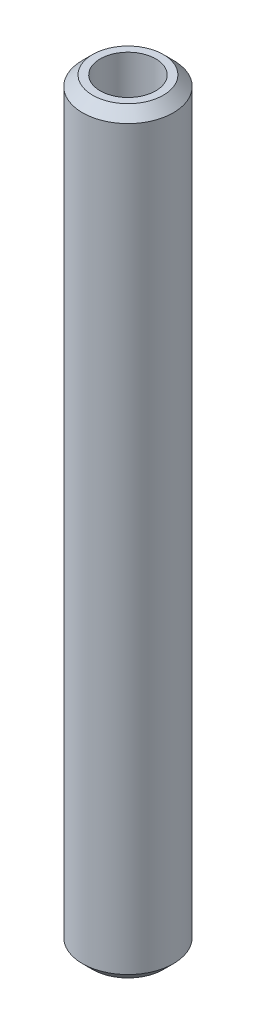
ISO-10303-21;
HEADER;
FILE_DESCRIPTION(('STEP AP214'),'2;1');
FILE_NAME('part.step','',(''),(''),'','','');
FILE_SCHEMA(('AUTOMOTIVE_DESIGN { 1 0 10303 214 1 1 1 1 }'));
ENDSEC;
DATA;
#1=APPLICATION_CONTEXT('core data for automotive mechanical design processes');
#2=APPLICATION_PROTOCOL_DEFINITION('international standard','automotive_design',2000,#1);
#3=PRODUCT_CONTEXT('',#1,'mechanical');
#4=PRODUCT('Part','Part','',(#3));
#5=PRODUCT_RELATED_PRODUCT_CATEGORY('part','',(#4));
#6=PRODUCT_DEFINITION_FORMATION('','',#4);
#7=PRODUCT_DEFINITION_CONTEXT('part definition',#1,'design');
#8=PRODUCT_DEFINITION('design','',#6,#7);
#9=PRODUCT_DEFINITION_SHAPE('','',#8);
#10=(LENGTH_UNIT() NAMED_UNIT(*) SI_UNIT(.MILLI.,.METRE.));
#11=(NAMED_UNIT(*) PLANE_ANGLE_UNIT() SI_UNIT($,.RADIAN.));
#12=(NAMED_UNIT(*) SI_UNIT($,.STERADIAN.) SOLID_ANGLE_UNIT());
#13=UNCERTAINTY_MEASURE_WITH_UNIT(LENGTH_MEASURE(1.E-05),#10,'distance_accuracy_value','');
#14=(GEOMETRIC_REPRESENTATION_CONTEXT(3) GLOBAL_UNCERTAINTY_ASSIGNED_CONTEXT((#13)) GLOBAL_UNIT_ASSIGNED_CONTEXT((#10,
#11,#12)) REPRESENTATION_CONTEXT('',''));
#15=CARTESIAN_POINT('',(0.,0.,0.));
#16=DIRECTION('',(0.,0.,1.));
#17=DIRECTION('',(1.,0.,0.));
#18=AXIS2_PLACEMENT_3D('',#15,#16,#17);
#19=CARTESIAN_POINT('',(0.,208.251954601007,0.));
#20=DIRECTION('',(0.,-1.,0.));
#21=DIRECTION('',(0.,0.,-1.));
#22=AXIS2_PLACEMENT_3D('',#19,#20,#21);
#23=CYLINDRICAL_SURFACE('',#22,12.5);
#24=CARTESIAN_POINT('',(0.,205.469727654196,0.));
#25=DIRECTION('',(0.,1.,0.));
#26=DIRECTION('',(0.,0.,1.));
#27=AXIS2_PLACEMENT_3D('',#24,#25,#26);
#28=CIRCLE('',#27,12.5);
#29=CARTESIAN_POINT('',(0.,205.469727654196,12.5));
#30=VERTEX_POINT('',#29);
#31=EDGE_CURVE('E50',#30,#30,#28,.F.);
#32=ORIENTED_EDGE('',*,*,#31,.T.);
#33=EDGE_LOOP('',(#32));
#34=FACE_BOUND('',#33,.T.);
#35=CARTESIAN_POINT('',(0.,2.78222694681066,0.));
#36=DIRECTION('',(0.,1.,0.));
#37=DIRECTION('',(0.,0.,1.));
#38=AXIS2_PLACEMENT_3D('',#35,#36,#37);
#39=CIRCLE('',#38,12.5);
#40=CARTESIAN_POINT('',(0.,2.78222694681066,12.5));
#41=VERTEX_POINT('',#40);
#42=EDGE_CURVE('E51',#41,#41,#39,.T.);
#43=ORIENTED_EDGE('',*,*,#42,.T.);
#44=EDGE_LOOP('',(#43));
#45=FACE_BOUND('',#44,.T.);
#46=ADVANCED_FACE('F39',(#34,#45),#23,.T.);
#47=CARTESIAN_POINT('',(0.,208.251954601007,0.));
#48=DIRECTION('',(0.,1.,0.));
#49=DIRECTION('',(0.,0.,1.));
#50=AXIS2_PLACEMENT_3D('',#47,#48,#49);
#51=PLANE('',#50);
#52=CARTESIAN_POINT('',(0.,208.251954601007,0.));
#53=DIRECTION('',(0.,1.,0.));
#54=DIRECTION('',(0.,0.,1.));
#55=AXIS2_PLACEMENT_3D('',#52,#53,#54);
#56=CIRCLE('',#55,9.71777305318935);
#57=CARTESIAN_POINT('',(0.,208.251954601007,9.71777305318935));
#58=VERTEX_POINT('',#57);
#59=EDGE_CURVE('E54',#58,#58,#56,.T.);
#60=ORIENTED_EDGE('',*,*,#59,.T.);
#61=EDGE_LOOP('',(#60));
#62=FACE_BOUND('',#61,.T.);
#63=CARTESIAN_POINT('',(0.,208.251954601007,0.));
#64=DIRECTION('',(0.,1.,0.));
#65=DIRECTION('',(0.,0.,1.));
#66=AXIS2_PLACEMENT_3D('',#63,#64,#65);
#67=CIRCLE('',#66,7.63894598467606);
#68=CARTESIAN_POINT('',(0.,208.251954601007,7.63894598467606));
#69=VERTEX_POINT('',#68);
#70=EDGE_CURVE('E58',#69,#69,#67,.T.);
#71=ORIENTED_EDGE('',*,*,#70,.F.);
#72=EDGE_LOOP('',(#71));
#73=FACE_BOUND('',#72,.T.);
#74=ADVANCED_FACE('F69',(#62,#73),#51,.T.);
#75=CARTESIAN_POINT('',(0.,0.,0.));
#76=DIRECTION('',(0.,1.,0.));
#77=DIRECTION('',(0.,0.,1.));
#78=AXIS2_PLACEMENT_3D('',#75,#76,#77);
#79=PLANE('',#78);
#80=CARTESIAN_POINT('',(0.,0.,0.));
#81=DIRECTION('',(0.,1.,0.));
#82=DIRECTION('',(0.,0.,1.));
#83=AXIS2_PLACEMENT_3D('',#80,#81,#82);
#84=CIRCLE('',#83,9.71777305318936);
#85=CARTESIAN_POINT('',(0.,0.,9.71777305318936));
#86=VERTEX_POINT('',#85);
#87=EDGE_CURVE('E10',#86,#86,#84,.F.);
#88=ORIENTED_EDGE('',*,*,#87,.T.);
#89=EDGE_LOOP('',(#88));
#90=FACE_BOUND('',#89,.T.);
#91=CARTESIAN_POINT('',(0.,0.,0.));
#92=DIRECTION('',(0.,1.,0.));
#93=DIRECTION('',(0.,0.,1.));
#94=AXIS2_PLACEMENT_3D('',#91,#92,#93);
#95=CIRCLE('',#94,7.63894598467606);
#96=CARTESIAN_POINT('',(0.,0.,7.63894598467606));
#97=VERTEX_POINT('',#96);
#98=EDGE_CURVE('E63',#97,#97,#95,.T.);
#99=ORIENTED_EDGE('',*,*,#98,.T.);
#100=EDGE_LOOP('',(#99));
#101=FACE_BOUND('',#100,.T.);
#102=ADVANCED_FACE('F75',(#90,#101),#79,.F.);
#103=CARTESIAN_POINT('',(0.,208.251954601007,0.));
#104=DIRECTION('',(0.,-1.,0.));
#105=DIRECTION('',(0.,0.,-1.));
#106=AXIS2_PLACEMENT_3D('',#103,#104,#105);
#107=CYLINDRICAL_SURFACE('',#106,7.63894598467606);
#108=ORIENTED_EDGE('',*,*,#70,.T.);
#109=EDGE_LOOP('',(#108));
#110=FACE_BOUND('',#109,.T.);
#111=ORIENTED_EDGE('',*,*,#98,.F.);
#112=EDGE_LOOP('',(#111));
#113=FACE_BOUND('',#112,.T.);
#114=ADVANCED_FACE('F70',(#110,#113),#107,.F.);
#115=CARTESIAN_POINT('',(0.,208.251954601007,0.));
#116=DIRECTION('',(0.,-1.,0.));
#117=DIRECTION('',(0.,0.,-1.));
#118=AXIS2_PLACEMENT_3D('',#115,#116,#117);
#119=CONICAL_SURFACE('',#118,9.71777305318935,0.785398163397446);
#120=ORIENTED_EDGE('',*,*,#31,.F.);
#121=EDGE_LOOP('',(#120));
#122=FACE_BOUND('',#121,.T.);
#123=ORIENTED_EDGE('',*,*,#59,.F.);
#124=EDGE_LOOP('',(#123));
#125=FACE_BOUND('',#124,.T.);
#126=ADVANCED_FACE('F81',(#122,#125),#119,.T.);
#127=CARTESIAN_POINT('',(0.,2.78222694681066,0.));
#128=DIRECTION('',(0.,1.,0.));
#129=DIRECTION('',(0.,0.,1.));
#130=AXIS2_PLACEMENT_3D('',#127,#128,#129);
#131=CONICAL_SURFACE('',#130,12.5,0.785398163397446);
#132=ORIENTED_EDGE('',*,*,#87,.F.);
#133=EDGE_LOOP('',(#132));
#134=FACE_BOUND('',#133,.T.);
#135=ORIENTED_EDGE('',*,*,#42,.F.);
#136=EDGE_LOOP('',(#135));
#137=FACE_BOUND('',#136,.T.);
#138=ADVANCED_FACE('F45',(#134,#137),#131,.T.);
#139=CLOSED_SHELL('',(#46,#74,#102,#114,#126,#138));
#140=MANIFOLD_SOLID_BREP('B2',#139);
#141=ADVANCED_BREP_SHAPE_REPRESENTATION('',(#18,#140),#14);
#142=SHAPE_DEFINITION_REPRESENTATION(#9,#141);
ENDSEC;
END-ISO-10303-21;
